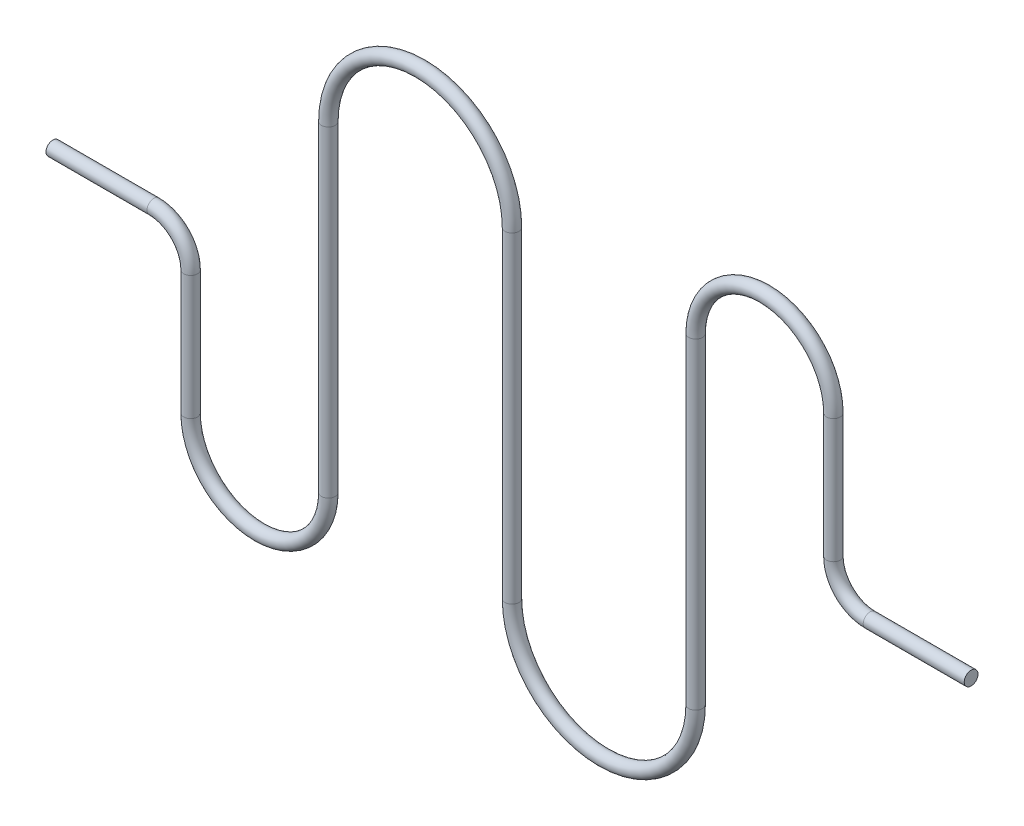
ISO-10303-21;
HEADER;
FILE_DESCRIPTION(('STEP AP214'),'2;1');
FILE_NAME('part.step','',(''),(''),'','','');
FILE_SCHEMA(('AUTOMOTIVE_DESIGN { 1 0 10303 214 1 1 1 1 }'));
ENDSEC;
DATA;
#1=APPLICATION_CONTEXT('core data for automotive mechanical design processes');
#2=APPLICATION_PROTOCOL_DEFINITION('international standard','automotive_design',2000,#1);
#3=PRODUCT_CONTEXT('',#1,'mechanical');
#4=PRODUCT('Part','Part','',(#3));
#5=PRODUCT_RELATED_PRODUCT_CATEGORY('part','',(#4));
#6=PRODUCT_DEFINITION_FORMATION('','',#4);
#7=PRODUCT_DEFINITION_CONTEXT('part definition',#1,'design');
#8=PRODUCT_DEFINITION('design','',#6,#7);
#9=PRODUCT_DEFINITION_SHAPE('','',#8);
#10=(LENGTH_UNIT() NAMED_UNIT(*) SI_UNIT(.MILLI.,.METRE.));
#11=(NAMED_UNIT(*) PLANE_ANGLE_UNIT() SI_UNIT($,.RADIAN.));
#12=(NAMED_UNIT(*) SI_UNIT($,.STERADIAN.) SOLID_ANGLE_UNIT());
#13=UNCERTAINTY_MEASURE_WITH_UNIT(LENGTH_MEASURE(1.E-05),#10,'distance_accuracy_value','');
#14=(GEOMETRIC_REPRESENTATION_CONTEXT(3) GLOBAL_UNCERTAINTY_ASSIGNED_CONTEXT((#13)) GLOBAL_UNIT_ASSIGNED_CONTEXT((#10,
#11,#12)) REPRESENTATION_CONTEXT('',''));
#15=CARTESIAN_POINT('',(0.,0.,0.));
#16=DIRECTION('',(0.,0.,1.));
#17=DIRECTION('',(1.,0.,0.));
#18=AXIS2_PLACEMENT_3D('',#15,#16,#17);
#19=CARTESIAN_POINT('',(-127.,0.,0.));
#20=DIRECTION('',(1.,0.,0.));
#21=DIRECTION('',(0.,0.,-1.));
#22=AXIS2_PLACEMENT_3D('',#19,#20,#21);
#23=PLANE('',#22);
#24=CARTESIAN_POINT('',(-127.,0.,0.));
#25=DIRECTION('',(1.,0.,0.));
#26=DIRECTION('',(0.,0.,-1.));
#27=AXIS2_PLACEMENT_3D('',#24,#25,#26);
#28=CIRCLE('',#27,1.905);
#29=CARTESIAN_POINT('',(-127.,0.,-1.905));
#30=VERTEX_POINT('',#29);
#31=EDGE_CURVE('E97',#30,#30,#28,.T.);
#32=ORIENTED_EDGE('',*,*,#31,.F.);
#33=EDGE_LOOP('',(#32));
#34=FACE_BOUND('',#33,.T.);
#35=ADVANCED_FACE('F36',(#34),#23,.F.);
#36=CARTESIAN_POINT('',(127.,0.,0.));
#37=DIRECTION('',(1.,0.,0.));
#38=DIRECTION('',(0.,0.,-1.));
#39=AXIS2_PLACEMENT_3D('',#36,#37,#38);
#40=PLANE('',#39);
#41=CARTESIAN_POINT('',(127.,0.,0.));
#42=DIRECTION('',(1.,0.,0.));
#43=DIRECTION('',(0.,0.,-1.));
#44=AXIS2_PLACEMENT_3D('',#41,#42,#43);
#45=CIRCLE('',#44,1.905);
#46=CARTESIAN_POINT('',(127.,0.,-1.905));
#47=VERTEX_POINT('',#46);
#48=EDGE_CURVE('E10',#47,#47,#45,.T.);
#49=ORIENTED_EDGE('',*,*,#48,.T.);
#50=EDGE_LOOP('',(#49));
#51=FACE_BOUND('',#50,.T.);
#52=ADVANCED_FACE('F106',(#51),#40,.T.);
#53=CARTESIAN_POINT('',(-127.,0.,0.));
#54=DIRECTION('',(1.,0.,0.));
#55=DIRECTION('',(0.,1.,0.));
#56=AXIS2_PLACEMENT_3D('',#53,#54,#55);
#57=CYLINDRICAL_SURFACE('',#56,1.905);
#58=CARTESIAN_POINT('',(-99.06,0.,0.));
#59=DIRECTION('',(1.,0.,0.));
#60=DIRECTION('',(0.,0.,-1.));
#61=AXIS2_PLACEMENT_3D('',#58,#59,#60);
#62=CIRCLE('',#61,1.905);
#63=CARTESIAN_POINT('',(-99.06,1.905,0.));
#64=VERTEX_POINT('',#63);
#65=EDGE_CURVE('E93',#64,#64,#62,.T.);
#66=ORIENTED_EDGE('',*,*,#65,.F.);
#67=EDGE_LOOP('',(#66));
#68=FACE_BOUND('',#67,.T.);
#69=ORIENTED_EDGE('',*,*,#31,.T.);
#70=EDGE_LOOP('',(#69));
#71=FACE_BOUND('',#70,.T.);
#72=ADVANCED_FACE('F103',(#68,#71),#57,.T.);
#73=CARTESIAN_POINT('',(-99.06,-10.16,0.));
#74=DIRECTION('',(0.,0.,-1.));
#75=DIRECTION('',(-1.,0.,0.));
#76=AXIS2_PLACEMENT_3D('',#73,#74,#75);
#77=TOROIDAL_SURFACE('',#76,10.16,1.905);
#78=CARTESIAN_POINT('',(-88.9,-10.16,0.));
#79=DIRECTION('',(0.,-1.,0.));
#80=DIRECTION('',(0.,0.,-1.));
#81=AXIS2_PLACEMENT_3D('',#78,#79,#80);
#82=CIRCLE('',#81,1.905);
#83=CARTESIAN_POINT('',(-86.995,-10.16,0.));
#84=VERTEX_POINT('',#83);
#85=EDGE_CURVE('E89',#84,#84,#82,.T.);
#86=CARTESIAN_POINT('',(-99.06,-10.16,0.));
#87=DIRECTION('',(0.,0.,-1.));
#88=DIRECTION('',(-1.,0.,0.));
#89=AXIS2_PLACEMENT_3D('',#86,#87,#88);
#90=CIRCLE('',#89,12.065);
#91=EDGE_CURVE('',#64,#84,#90,.T.);
#92=ORIENTED_EDGE('',*,*,#65,.T.);
#93=ORIENTED_EDGE('',*,*,#85,.F.);
#94=ORIENTED_EDGE('',*,*,#91,.T.);
#95=ORIENTED_EDGE('',*,*,#91,.F.);
#96=EDGE_LOOP('',(#92,#94,#93,#95));
#97=FACE_BOUND('',#96,.T.);
#98=ADVANCED_FACE('F156',(#97),#77,.T.);
#99=CARTESIAN_POINT('',(-88.9,-10.16,0.));
#100=DIRECTION('',(0.,-1.,0.));
#101=DIRECTION('',(1.,0.,0.));
#102=AXIS2_PLACEMENT_3D('',#99,#100,#101);
#103=CYLINDRICAL_SURFACE('',#102,1.905);
#104=CARTESIAN_POINT('',(-88.9,-44.45,0.));
#105=DIRECTION('',(0.,-1.,0.));
#106=DIRECTION('',(0.,0.,-1.));
#107=AXIS2_PLACEMENT_3D('',#104,#105,#106);
#108=CIRCLE('',#107,1.905);
#109=CARTESIAN_POINT('',(-90.805,-44.45,0.));
#110=VERTEX_POINT('',#109);
#111=EDGE_CURVE('E85',#110,#110,#108,.T.);
#112=ORIENTED_EDGE('',*,*,#111,.F.);
#113=EDGE_LOOP('',(#112));
#114=FACE_BOUND('',#113,.T.);
#115=ORIENTED_EDGE('',*,*,#85,.T.);
#116=EDGE_LOOP('',(#115));
#117=FACE_BOUND('',#116,.T.);
#118=ADVANCED_FACE('F152',(#114,#117),#103,.T.);
#119=CARTESIAN_POINT('',(-69.85,-44.45,0.));
#120=DIRECTION('',(0.,0.,1.));
#121=DIRECTION('',(1.,0.,0.));
#122=AXIS2_PLACEMENT_3D('',#119,#120,#121);
#123=TOROIDAL_SURFACE('',#122,19.05,1.905);
#124=CARTESIAN_POINT('',(-50.8,-44.45,0.));
#125=DIRECTION('',(0.,1.,0.));
#126=DIRECTION('',(0.,0.,-1.));
#127=AXIS2_PLACEMENT_3D('',#124,#125,#126);
#128=CIRCLE('',#127,1.905);
#129=CARTESIAN_POINT('',(-48.895,-44.45,0.));
#130=VERTEX_POINT('',#129);
#131=EDGE_CURVE('E81',#130,#130,#128,.T.);
#132=CARTESIAN_POINT('',(-69.85,-44.45,0.));
#133=DIRECTION('',(0.,0.,1.));
#134=DIRECTION('',(1.,0.,0.));
#135=AXIS2_PLACEMENT_3D('',#132,#133,#134);
#136=CIRCLE('',#135,20.955);
#137=EDGE_CURVE('',#110,#130,#136,.T.);
#138=ORIENTED_EDGE('',*,*,#111,.T.);
#139=ORIENTED_EDGE('',*,*,#131,.F.);
#140=ORIENTED_EDGE('',*,*,#137,.T.);
#141=ORIENTED_EDGE('',*,*,#137,.F.);
#142=EDGE_LOOP('',(#138,#140,#139,#141));
#143=FACE_BOUND('',#142,.T.);
#144=ADVANCED_FACE('F148',(#143),#123,.T.);
#145=CARTESIAN_POINT('',(-50.8,-44.45,0.));
#146=DIRECTION('',(0.,1.,0.));
#147=DIRECTION('',(-1.,0.,0.));
#148=AXIS2_PLACEMENT_3D('',#145,#146,#147);
#149=CYLINDRICAL_SURFACE('',#148,1.905);
#150=CARTESIAN_POINT('',(-50.8,44.45,0.));
#151=DIRECTION('',(0.,1.,0.));
#152=DIRECTION('',(0.,0.,-1.));
#153=AXIS2_PLACEMENT_3D('',#150,#151,#152);
#154=CIRCLE('',#153,1.905);
#155=CARTESIAN_POINT('',(-52.705,44.45,0.));
#156=VERTEX_POINT('',#155);
#157=EDGE_CURVE('E77',#156,#156,#154,.T.);
#158=ORIENTED_EDGE('',*,*,#157,.F.);
#159=EDGE_LOOP('',(#158));
#160=FACE_BOUND('',#159,.T.);
#161=ORIENTED_EDGE('',*,*,#131,.T.);
#162=EDGE_LOOP('',(#161));
#163=FACE_BOUND('',#162,.T.);
#164=ADVANCED_FACE('F144',(#160,#163),#149,.T.);
#165=CARTESIAN_POINT('',(-25.4,44.45,0.));
#166=DIRECTION('',(0.,0.,-1.));
#167=DIRECTION('',(-1.,0.,0.));
#168=AXIS2_PLACEMENT_3D('',#165,#166,#167);
#169=TOROIDAL_SURFACE('',#168,25.4,1.905);
#170=CARTESIAN_POINT('',(0.,44.45,0.));
#171=DIRECTION('',(0.,-1.,0.));
#172=DIRECTION('',(0.,0.,-1.));
#173=AXIS2_PLACEMENT_3D('',#170,#171,#172);
#174=CIRCLE('',#173,1.905);
#175=CARTESIAN_POINT('',(1.90499999999999,44.45,0.));
#176=VERTEX_POINT('',#175);
#177=EDGE_CURVE('E73',#176,#176,#174,.T.);
#178=CARTESIAN_POINT('',(-25.4,44.45,0.));
#179=DIRECTION('',(0.,0.,-1.));
#180=DIRECTION('',(-1.,0.,0.));
#181=AXIS2_PLACEMENT_3D('',#178,#179,#180);
#182=CIRCLE('',#181,27.305);
#183=EDGE_CURVE('',#156,#176,#182,.T.);
#184=ORIENTED_EDGE('',*,*,#157,.T.);
#185=ORIENTED_EDGE('',*,*,#177,.F.);
#186=ORIENTED_EDGE('',*,*,#183,.T.);
#187=ORIENTED_EDGE('',*,*,#183,.F.);
#188=EDGE_LOOP('',(#184,#186,#185,#187));
#189=FACE_BOUND('',#188,.T.);
#190=ADVANCED_FACE('F140',(#189),#169,.T.);
#191=CARTESIAN_POINT('',(0.,44.45,0.));
#192=DIRECTION('',(0.,-1.,0.));
#193=DIRECTION('',(1.,0.,0.));
#194=AXIS2_PLACEMENT_3D('',#191,#192,#193);
#195=CYLINDRICAL_SURFACE('',#194,1.905);
#196=CARTESIAN_POINT('',(0.,-44.45,0.));
#197=DIRECTION('',(0.,-1.,0.));
#198=DIRECTION('',(0.,0.,-1.));
#199=AXIS2_PLACEMENT_3D('',#196,#197,#198);
#200=CIRCLE('',#199,1.905);
#201=CARTESIAN_POINT('',(-1.905,-44.45,0.));
#202=VERTEX_POINT('',#201);
#203=EDGE_CURVE('E69',#202,#202,#200,.T.);
#204=ORIENTED_EDGE('',*,*,#203,.F.);
#205=EDGE_LOOP('',(#204));
#206=FACE_BOUND('',#205,.T.);
#207=ORIENTED_EDGE('',*,*,#177,.T.);
#208=EDGE_LOOP('',(#207));
#209=FACE_BOUND('',#208,.T.);
#210=ADVANCED_FACE('F136',(#206,#209),#195,.T.);
#211=CARTESIAN_POINT('',(25.4,-44.45,0.));
#212=DIRECTION('',(0.,0.,1.));
#213=DIRECTION('',(1.,0.,0.));
#214=AXIS2_PLACEMENT_3D('',#211,#212,#213);
#215=TOROIDAL_SURFACE('',#214,25.4,1.905);
#216=CARTESIAN_POINT('',(50.8,-44.45,0.));
#217=DIRECTION('',(0.,1.,0.));
#218=DIRECTION('',(0.,0.,-1.));
#219=AXIS2_PLACEMENT_3D('',#216,#217,#218);
#220=CIRCLE('',#219,1.905);
#221=CARTESIAN_POINT('',(52.705,-44.45,0.));
#222=VERTEX_POINT('',#221);
#223=EDGE_CURVE('E65',#222,#222,#220,.T.);
#224=CARTESIAN_POINT('',(25.4,-44.45,0.));
#225=DIRECTION('',(0.,0.,1.));
#226=DIRECTION('',(1.,0.,0.));
#227=AXIS2_PLACEMENT_3D('',#224,#225,#226);
#228=CIRCLE('',#227,27.305);
#229=EDGE_CURVE('',#202,#222,#228,.T.);
#230=ORIENTED_EDGE('',*,*,#203,.T.);
#231=ORIENTED_EDGE('',*,*,#223,.F.);
#232=ORIENTED_EDGE('',*,*,#229,.T.);
#233=ORIENTED_EDGE('',*,*,#229,.F.);
#234=EDGE_LOOP('',(#230,#232,#231,#233));
#235=FACE_BOUND('',#234,.T.);
#236=ADVANCED_FACE('F132',(#235),#215,.T.);
#237=CARTESIAN_POINT('',(50.8,-44.45,0.));
#238=DIRECTION('',(0.,1.,0.));
#239=DIRECTION('',(0.,0.,1.));
#240=AXIS2_PLACEMENT_3D('',#237,#238,#239);
#241=CYLINDRICAL_SURFACE('',#240,1.905);
#242=CARTESIAN_POINT('',(50.8,44.45,0.));
#243=DIRECTION('',(0.,1.,0.));
#244=DIRECTION('',(0.,0.,-1.));
#245=AXIS2_PLACEMENT_3D('',#242,#243,#244);
#246=CIRCLE('',#245,1.905);
#247=CARTESIAN_POINT('',(48.895,44.45,0.));
#248=VERTEX_POINT('',#247);
#249=EDGE_CURVE('E61',#248,#248,#246,.T.);
#250=ORIENTED_EDGE('',*,*,#249,.F.);
#251=EDGE_LOOP('',(#250));
#252=FACE_BOUND('',#251,.T.);
#253=ORIENTED_EDGE('',*,*,#223,.T.);
#254=EDGE_LOOP('',(#253));
#255=FACE_BOUND('',#254,.T.);
#256=ADVANCED_FACE('F128',(#252,#255),#241,.T.);
#257=CARTESIAN_POINT('',(69.85,44.45,0.));
#258=DIRECTION('',(0.,0.,-1.));
#259=DIRECTION('',(-1.,0.,0.));
#260=AXIS2_PLACEMENT_3D('',#257,#258,#259);
#261=TOROIDAL_SURFACE('',#260,19.05,1.905);
#262=CARTESIAN_POINT('',(88.9,44.45,0.));
#263=DIRECTION('',(0.,-1.,0.));
#264=DIRECTION('',(0.,0.,-1.));
#265=AXIS2_PLACEMENT_3D('',#262,#263,#264);
#266=CIRCLE('',#265,1.905);
#267=CARTESIAN_POINT('',(90.805,44.45,0.));
#268=VERTEX_POINT('',#267);
#269=EDGE_CURVE('E55',#268,#268,#266,.T.);
#270=CARTESIAN_POINT('',(69.85,44.45,0.));
#271=DIRECTION('',(0.,0.,-1.));
#272=DIRECTION('',(-1.,0.,0.));
#273=AXIS2_PLACEMENT_3D('',#270,#271,#272);
#274=CIRCLE('',#273,20.955);
#275=EDGE_CURVE('',#248,#268,#274,.T.);
#276=ORIENTED_EDGE('',*,*,#249,.T.);
#277=ORIENTED_EDGE('',*,*,#269,.F.);
#278=ORIENTED_EDGE('',*,*,#275,.T.);
#279=ORIENTED_EDGE('',*,*,#275,.F.);
#280=EDGE_LOOP('',(#276,#278,#277,#279));
#281=FACE_BOUND('',#280,.T.);
#282=ADVANCED_FACE('F124',(#281),#261,.T.);
#283=CARTESIAN_POINT('',(88.9,44.45,0.));
#284=DIRECTION('',(0.,-1.,0.));
#285=DIRECTION('',(0.,0.,-1.));
#286=AXIS2_PLACEMENT_3D('',#283,#284,#285);
#287=CYLINDRICAL_SURFACE('',#286,1.905);
#288=CARTESIAN_POINT('',(88.9,10.16,0.));
#289=DIRECTION('',(0.,-1.,0.));
#290=DIRECTION('',(0.,0.,-1.));
#291=AXIS2_PLACEMENT_3D('',#288,#289,#290);
#292=CIRCLE('',#291,1.905);
#293=CARTESIAN_POINT('',(86.995,10.16,0.));
#294=VERTEX_POINT('',#293);
#295=EDGE_CURVE('E49',#294,#294,#292,.T.);
#296=ORIENTED_EDGE('',*,*,#295,.F.);
#297=EDGE_LOOP('',(#296));
#298=FACE_BOUND('',#297,.T.);
#299=ORIENTED_EDGE('',*,*,#269,.T.);
#300=EDGE_LOOP('',(#299));
#301=FACE_BOUND('',#300,.T.);
#302=ADVANCED_FACE('F118',(#298,#301),#287,.T.);
#303=CARTESIAN_POINT('',(99.06,10.16,0.));
#304=DIRECTION('',(0.,0.,1.));
#305=DIRECTION('',(1.,0.,0.));
#306=AXIS2_PLACEMENT_3D('',#303,#304,#305);
#307=TOROIDAL_SURFACE('',#306,10.16,1.905);
#308=CARTESIAN_POINT('',(99.06,0.,0.));
#309=DIRECTION('',(1.,0.,0.));
#310=DIRECTION('',(0.,0.,-1.));
#311=AXIS2_PLACEMENT_3D('',#308,#309,#310);
#312=CIRCLE('',#311,1.905);
#313=CARTESIAN_POINT('',(99.06,-1.905,0.));
#314=VERTEX_POINT('',#313);
#315=EDGE_CURVE('E43',#314,#314,#312,.T.);
#316=CARTESIAN_POINT('',(99.06,10.16,0.));
#317=DIRECTION('',(0.,0.,1.));
#318=DIRECTION('',(1.,0.,0.));
#319=AXIS2_PLACEMENT_3D('',#316,#317,#318);
#320=CIRCLE('',#319,12.065);
#321=EDGE_CURVE('',#294,#314,#320,.T.);
#322=ORIENTED_EDGE('',*,*,#295,.T.);
#323=ORIENTED_EDGE('',*,*,#315,.F.);
#324=ORIENTED_EDGE('',*,*,#321,.T.);
#325=ORIENTED_EDGE('',*,*,#321,.F.);
#326=EDGE_LOOP('',(#322,#324,#323,#325));
#327=FACE_BOUND('',#326,.T.);
#328=ADVANCED_FACE('F112',(#327),#307,.T.);
#329=CARTESIAN_POINT('',(99.06,0.,0.));
#330=DIRECTION('',(1.,0.,0.));
#331=DIRECTION('',(0.,0.,-1.));
#332=AXIS2_PLACEMENT_3D('',#329,#330,#331);
#333=CYLINDRICAL_SURFACE('',#332,1.905);
#334=ORIENTED_EDGE('',*,*,#48,.F.);
#335=EDGE_LOOP('',(#334));
#336=FACE_BOUND('',#335,.T.);
#337=ORIENTED_EDGE('',*,*,#315,.T.);
#338=EDGE_LOOP('',(#337));
#339=FACE_BOUND('',#338,.T.);
#340=ADVANCED_FACE('F110',(#336,#339),#333,.T.);
#341=CLOSED_SHELL('',(#35,#52,#72,#98,#118,#144,#164,#190,#210,#236,#256,#282,#302,#328,#340));
#342=MANIFOLD_SOLID_BREP('B2',#341);
#343=ADVANCED_BREP_SHAPE_REPRESENTATION('',(#18,#342),#14);
#344=SHAPE_DEFINITION_REPRESENTATION(#9,#343);
ENDSEC;
END-ISO-10303-21;
